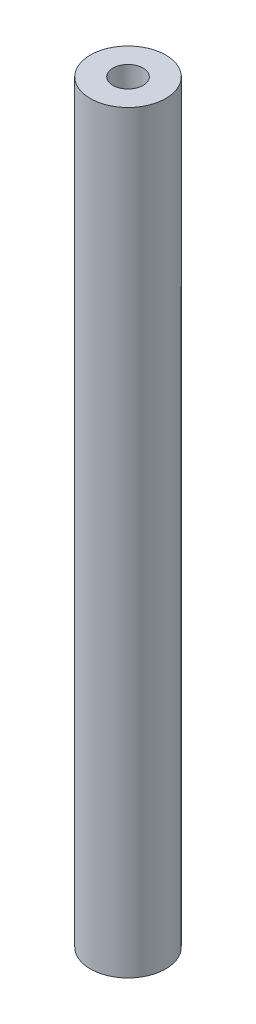
ISO-10303-21;
HEADER;
FILE_DESCRIPTION(('STEP AP214'),'2;1');
FILE_NAME('part.step','',(''),(''),'','','');
FILE_SCHEMA(('AUTOMOTIVE_DESIGN { 1 0 10303 214 1 1 1 1 }'));
ENDSEC;
DATA;
#1=APPLICATION_CONTEXT('core data for automotive mechanical design processes');
#2=APPLICATION_PROTOCOL_DEFINITION('international standard','automotive_design',2000,#1);
#3=PRODUCT_CONTEXT('',#1,'mechanical');
#4=PRODUCT('Part','Part','',(#3));
#5=PRODUCT_RELATED_PRODUCT_CATEGORY('part','',(#4));
#6=PRODUCT_DEFINITION_FORMATION('','',#4);
#7=PRODUCT_DEFINITION_CONTEXT('part definition',#1,'design');
#8=PRODUCT_DEFINITION('design','',#6,#7);
#9=PRODUCT_DEFINITION_SHAPE('','',#8);
#10=(LENGTH_UNIT() NAMED_UNIT(*) SI_UNIT(.MILLI.,.METRE.));
#11=(NAMED_UNIT(*) PLANE_ANGLE_UNIT() SI_UNIT($,.RADIAN.));
#12=(NAMED_UNIT(*) SI_UNIT($,.STERADIAN.) SOLID_ANGLE_UNIT());
#13=UNCERTAINTY_MEASURE_WITH_UNIT(LENGTH_MEASURE(1.E-05),#10,'distance_accuracy_value','');
#14=(GEOMETRIC_REPRESENTATION_CONTEXT(3) GLOBAL_UNCERTAINTY_ASSIGNED_CONTEXT((#13)) GLOBAL_UNIT_ASSIGNED_CONTEXT((#10,
#11,#12)) REPRESENTATION_CONTEXT('',''));
#15=CARTESIAN_POINT('',(0.,0.,0.));
#16=DIRECTION('',(0.,0.,1.));
#17=DIRECTION('',(1.,0.,0.));
#18=AXIS2_PLACEMENT_3D('',#15,#16,#17);
#19=CARTESIAN_POINT('',(0.,0.,0.));
#20=DIRECTION('',(0.,-1.,0.));
#21=DIRECTION('',(0.,0.,-1.));
#22=AXIS2_PLACEMENT_3D('',#19,#20,#21);
#23=CYLINDRICAL_SURFACE('',#22,1.5);
#24=CARTESIAN_POINT('',(0.,30.,0.));
#25=DIRECTION('',(0.,-1.,0.));
#26=DIRECTION('',(0.,0.,-1.));
#27=AXIS2_PLACEMENT_3D('',#24,#25,#26);
#28=CIRCLE('',#27,1.5);
#29=CARTESIAN_POINT('',(0.,30.,-1.5));
#30=VERTEX_POINT('',#29);
#31=EDGE_CURVE('E43',#30,#30,#28,.T.);
#32=ORIENTED_EDGE('',*,*,#31,.T.);
#33=EDGE_LOOP('',(#32));
#34=FACE_BOUND('',#33,.T.);
#35=CARTESIAN_POINT('',(0.,0.,0.));
#36=DIRECTION('',(0.,-1.,0.));
#37=DIRECTION('',(0.,0.,-1.));
#38=AXIS2_PLACEMENT_3D('',#35,#36,#37);
#39=CIRCLE('',#38,1.5);
#40=CARTESIAN_POINT('',(0.,0.,-1.5));
#41=VERTEX_POINT('',#40);
#42=EDGE_CURVE('E10',#41,#41,#39,.T.);
#43=ORIENTED_EDGE('',*,*,#42,.F.);
#44=EDGE_LOOP('',(#43));
#45=FACE_BOUND('',#44,.T.);
#46=ADVANCED_FACE('F29',(#34,#45),#23,.T.);
#47=CARTESIAN_POINT('',(0.6,0.,0.));
#48=DIRECTION('',(0.,-1.,0.));
#49=DIRECTION('',(0.,0.,-1.));
#50=AXIS2_PLACEMENT_3D('',#47,#48,#49);
#51=PLANE('',#50);
#52=ORIENTED_EDGE('',*,*,#42,.T.);
#53=EDGE_LOOP('',(#52));
#54=FACE_BOUND('',#53,.T.);
#55=CARTESIAN_POINT('',(0.,0.,0.));
#56=DIRECTION('',(0.,-1.,0.));
#57=DIRECTION('',(0.,0.,-1.));
#58=AXIS2_PLACEMENT_3D('',#55,#56,#57);
#59=CIRCLE('',#58,0.6);
#60=CARTESIAN_POINT('',(0.,0.,-0.6));
#61=VERTEX_POINT('',#60);
#62=EDGE_CURVE('E35',#61,#61,#59,.T.);
#63=ORIENTED_EDGE('',*,*,#62,.F.);
#64=EDGE_LOOP('',(#63));
#65=FACE_BOUND('',#64,.T.);
#66=ADVANCED_FACE('F59',(#54,#65),#51,.T.);
#67=CARTESIAN_POINT('',(0.,0.,0.));
#68=DIRECTION('',(0.,-1.,0.));
#69=DIRECTION('',(0.,0.,-1.));
#70=AXIS2_PLACEMENT_3D('',#67,#68,#69);
#71=CYLINDRICAL_SURFACE('',#70,0.6);
#72=ORIENTED_EDGE('',*,*,#62,.T.);
#73=EDGE_LOOP('',(#72));
#74=FACE_BOUND('',#73,.T.);
#75=CARTESIAN_POINT('',(0.,30.,0.));
#76=DIRECTION('',(0.,-1.,0.));
#77=DIRECTION('',(0.,0.,-1.));
#78=AXIS2_PLACEMENT_3D('',#75,#76,#77);
#79=CIRCLE('',#78,0.6);
#80=CARTESIAN_POINT('',(0.,30.,-0.6));
#81=VERTEX_POINT('',#80);
#82=EDGE_CURVE('E39',#81,#81,#79,.T.);
#83=ORIENTED_EDGE('',*,*,#82,.F.);
#84=EDGE_LOOP('',(#83));
#85=FACE_BOUND('',#84,.T.);
#86=ADVANCED_FACE('F53',(#74,#85),#71,.F.);
#87=CARTESIAN_POINT('',(0.6,30.,0.));
#88=DIRECTION('',(0.,1.,0.));
#89=DIRECTION('',(0.,0.,1.));
#90=AXIS2_PLACEMENT_3D('',#87,#88,#89);
#91=PLANE('',#90);
#92=ORIENTED_EDGE('',*,*,#82,.T.);
#93=EDGE_LOOP('',(#92));
#94=FACE_BOUND('',#93,.T.);
#95=ORIENTED_EDGE('',*,*,#31,.F.);
#96=EDGE_LOOP('',(#95));
#97=FACE_BOUND('',#96,.T.);
#98=ADVANCED_FACE('F51',(#94,#97),#91,.T.);
#99=CLOSED_SHELL('',(#46,#66,#86,#98));
#100=MANIFOLD_SOLID_BREP('B2',#99);
#101=ADVANCED_BREP_SHAPE_REPRESENTATION('',(#18,#100),#14);
#102=SHAPE_DEFINITION_REPRESENTATION(#9,#101);
ENDSEC;
END-ISO-10303-21;
